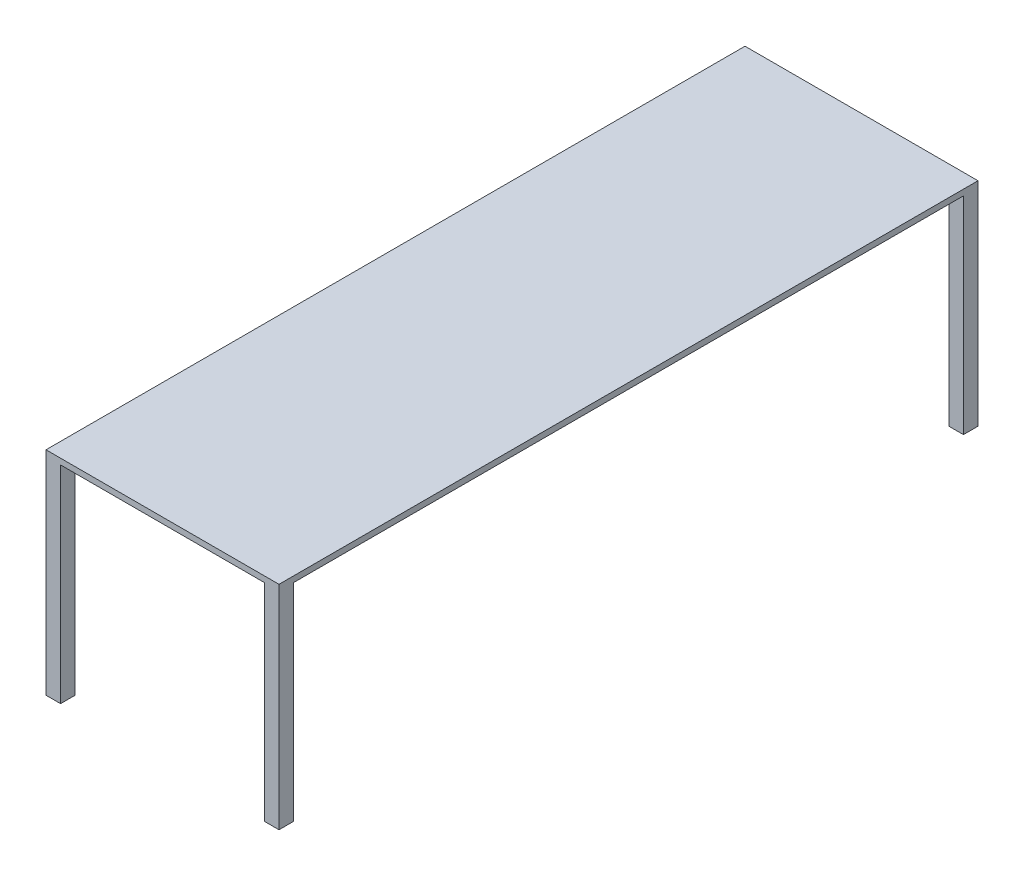
ISO-10303-21;
HEADER;
FILE_DESCRIPTION(('STEP AP214'),'2;1');
FILE_NAME('part.step','',(''),(''),'','','');
FILE_SCHEMA(('AUTOMOTIVE_DESIGN { 1 0 10303 214 1 1 1 1 }'));
ENDSEC;
DATA;
#1=APPLICATION_CONTEXT('core data for automotive mechanical design processes');
#2=APPLICATION_PROTOCOL_DEFINITION('international standard','automotive_design',2000,#1);
#3=PRODUCT_CONTEXT('',#1,'mechanical');
#4=PRODUCT('Part','Part','',(#3));
#5=PRODUCT_RELATED_PRODUCT_CATEGORY('part','',(#4));
#6=PRODUCT_DEFINITION_FORMATION('','',#4);
#7=PRODUCT_DEFINITION_CONTEXT('part definition',#1,'design');
#8=PRODUCT_DEFINITION('design','',#6,#7);
#9=PRODUCT_DEFINITION_SHAPE('','',#8);
#10=(LENGTH_UNIT() NAMED_UNIT(*) SI_UNIT(.MILLI.,.METRE.));
#11=(NAMED_UNIT(*) PLANE_ANGLE_UNIT() SI_UNIT($,.RADIAN.));
#12=(NAMED_UNIT(*) SI_UNIT($,.STERADIAN.) SOLID_ANGLE_UNIT());
#13=UNCERTAINTY_MEASURE_WITH_UNIT(LENGTH_MEASURE(1.E-05),#10,'distance_accuracy_value','');
#14=(GEOMETRIC_REPRESENTATION_CONTEXT(3) GLOBAL_UNCERTAINTY_ASSIGNED_CONTEXT((#13)) GLOBAL_UNIT_ASSIGNED_CONTEXT((#10,
#11,#12)) REPRESENTATION_CONTEXT('',''));
#15=CARTESIAN_POINT('',(0.,0.,0.));
#16=DIRECTION('',(0.,0.,1.));
#17=DIRECTION('',(1.,0.,0.));
#18=AXIS2_PLACEMENT_3D('',#15,#16,#17);
#19=CARTESIAN_POINT('',(0.,0.,0.));
#20=DIRECTION('',(0.,-1.,0.));
#21=DIRECTION('',(0.,0.,-1.));
#22=AXIS2_PLACEMENT_3D('',#19,#20,#21);
#23=PLANE('',#22);
#24=DIRECTION('',(-1.,0.,0.));
#25=VECTOR('',#24,1.);
#26=CARTESIAN_POINT('',(-400.,0.,-1150.));
#27=LINE('',#26,#25);
#28=CARTESIAN_POINT('',(-350.,0.,-1150.));
#29=VERTEX_POINT('',#28);
#30=CARTESIAN_POINT('',(-400.,0.,-1150.));
#31=VERTEX_POINT('',#30);
#32=EDGE_CURVE('E178',#29,#31,#27,.T.);
#33=ORIENTED_EDGE('',*,*,#32,.F.);
#34=DIRECTION('',(0.,0.,1.));
#35=VECTOR('',#34,1.);
#36=CARTESIAN_POINT('',(-350.,0.,-1200.));
#37=LINE('',#36,#35);
#38=CARTESIAN_POINT('',(-350.,0.,-1200.));
#39=VERTEX_POINT('',#38);
#40=EDGE_CURVE('E181',#39,#29,#37,.T.);
#41=ORIENTED_EDGE('',*,*,#40,.F.);
#42=DIRECTION('',(-1.,0.,0.));
#43=VECTOR('',#42,1.);
#44=CARTESIAN_POINT('',(-400.,0.,-1200.));
#45=LINE('',#44,#43);
#46=CARTESIAN_POINT('',(350.,0.,-1200.));
#47=VERTEX_POINT('',#46);
#48=EDGE_CURVE('E314',#47,#39,#45,.T.);
#49=ORIENTED_EDGE('',*,*,#48,.F.);
#50=DIRECTION('',(0.,0.,1.));
#51=VECTOR('',#50,1.);
#52=CARTESIAN_POINT('',(350.,0.,-1200.));
#53=LINE('',#52,#51);
#54=CARTESIAN_POINT('',(350.,0.,-1150.));
#55=VERTEX_POINT('',#54);
#56=EDGE_CURVE('E235',#47,#55,#53,.T.);
#57=ORIENTED_EDGE('',*,*,#56,.T.);
#58=DIRECTION('',(1.,0.,0.));
#59=VECTOR('',#58,1.);
#60=CARTESIAN_POINT('',(400.,0.,-1150.));
#61=LINE('',#60,#59);
#62=CARTESIAN_POINT('',(400.,0.,-1150.));
#63=VERTEX_POINT('',#62);
#64=EDGE_CURVE('E229',#55,#63,#61,.T.);
#65=ORIENTED_EDGE('',*,*,#64,.T.);
#66=DIRECTION('',(0.,0.,-1.));
#67=VECTOR('',#66,1.);
#68=CARTESIAN_POINT('',(400.,0.,1200.));
#69=LINE('',#68,#67);
#70=CARTESIAN_POINT('',(400.,0.,1150.));
#71=VERTEX_POINT('',#70);
#72=EDGE_CURVE('E296',#71,#63,#69,.T.);
#73=ORIENTED_EDGE('',*,*,#72,.F.);
#74=DIRECTION('',(1.,0.,0.));
#75=VECTOR('',#74,1.);
#76=CARTESIAN_POINT('',(400.,0.,1150.));
#77=LINE('',#76,#75);
#78=CARTESIAN_POINT('',(350.,0.,1150.));
#79=VERTEX_POINT('',#78);
#80=EDGE_CURVE('E269',#79,#71,#77,.T.);
#81=ORIENTED_EDGE('',*,*,#80,.F.);
#82=DIRECTION('',(0.,0.,-1.));
#83=VECTOR('',#82,1.);
#84=CARTESIAN_POINT('',(350.,0.,1200.));
#85=LINE('',#84,#83);
#86=CARTESIAN_POINT('',(350.,0.,1200.));
#87=VERTEX_POINT('',#86);
#88=EDGE_CURVE('E263',#87,#79,#85,.T.);
#89=ORIENTED_EDGE('',*,*,#88,.F.);
#90=DIRECTION('',(1.,0.,0.));
#91=VECTOR('',#90,1.);
#92=CARTESIAN_POINT('',(-400.,0.,1200.));
#93=LINE('',#92,#91);
#94=CARTESIAN_POINT('',(-350.,0.,1200.));
#95=VERTEX_POINT('',#94);
#96=EDGE_CURVE('E302',#95,#87,#93,.T.);
#97=ORIENTED_EDGE('',*,*,#96,.F.);
#98=DIRECTION('',(0.,0.,-1.));
#99=VECTOR('',#98,1.);
#100=CARTESIAN_POINT('',(-350.,0.,1200.));
#101=LINE('',#100,#99);
#102=CARTESIAN_POINT('',(-350.,0.,1150.));
#103=VERTEX_POINT('',#102);
#104=EDGE_CURVE('E63',#95,#103,#101,.T.);
#105=ORIENTED_EDGE('',*,*,#104,.T.);
#106=DIRECTION('',(-1.,0.,0.));
#107=VECTOR('',#106,1.);
#108=CARTESIAN_POINT('',(-400.,0.,1150.));
#109=LINE('',#108,#107);
#110=CARTESIAN_POINT('',(-400.,0.,1150.));
#111=VERTEX_POINT('',#110);
#112=EDGE_CURVE('E197',#103,#111,#109,.T.);
#113=ORIENTED_EDGE('',*,*,#112,.T.);
#114=DIRECTION('',(0.,0.,1.));
#115=VECTOR('',#114,1.);
#116=CARTESIAN_POINT('',(-400.,0.,1200.));
#117=LINE('',#116,#115);
#118=EDGE_CURVE('E317',#31,#111,#117,.T.);
#119=ORIENTED_EDGE('',*,*,#118,.F.);
#120=EDGE_LOOP('',(#33,#41,#49,#57,#65,#73,#81,#89,#97,#105,#113,#119));
#121=FACE_BOUND('',#120,.T.);
#122=ADVANCED_FACE('F39',(#121),#23,.T.);
#123=CARTESIAN_POINT('',(400.,20.,1200.));
#124=DIRECTION('',(-1.,0.,0.));
#125=DIRECTION('',(0.,0.,1.));
#126=AXIS2_PLACEMENT_3D('',#123,#124,#125);
#127=PLANE('',#126);
#128=DIRECTION('',(0.,-1.,0.));
#129=VECTOR('',#128,1.);
#130=CARTESIAN_POINT('',(400.,20.,1200.));
#131=LINE('',#130,#129);
#132=CARTESIAN_POINT('',(400.,20.,1200.));
#133=VERTEX_POINT('',#132);
#134=CARTESIAN_POINT('',(400.,-710.,1200.));
#135=VERTEX_POINT('',#134);
#136=EDGE_CURVE('E310',#133,#135,#131,.T.);
#137=ORIENTED_EDGE('',*,*,#136,.T.);
#138=DIRECTION('',(0.,0.,1.));
#139=VECTOR('',#138,1.);
#140=CARTESIAN_POINT('',(400.,-710.,1200.));
#141=LINE('',#140,#139);
#142=CARTESIAN_POINT('',(400.,-710.,1150.));
#143=VERTEX_POINT('',#142);
#144=EDGE_CURVE('E264',#143,#135,#141,.T.);
#145=ORIENTED_EDGE('',*,*,#144,.F.);
#146=DIRECTION('',(0.,1.,0.));
#147=VECTOR('',#146,1.);
#148=CARTESIAN_POINT('',(400.,-710.,1150.));
#149=LINE('',#148,#147);
#150=EDGE_CURVE('E278',#143,#71,#149,.T.);
#151=ORIENTED_EDGE('',*,*,#150,.T.);
#152=ORIENTED_EDGE('',*,*,#72,.T.);
#153=DIRECTION('',(0.,1.,0.));
#154=VECTOR('',#153,1.);
#155=CARTESIAN_POINT('',(400.,-710.,-1150.));
#156=LINE('',#155,#154);
#157=CARTESIAN_POINT('',(400.,-710.,-1150.));
#158=VERTEX_POINT('',#157);
#159=EDGE_CURVE('E260',#158,#63,#156,.T.);
#160=ORIENTED_EDGE('',*,*,#159,.F.);
#161=DIRECTION('',(0.,0.,-1.));
#162=VECTOR('',#161,1.);
#163=CARTESIAN_POINT('',(400.,-710.,-1200.));
#164=LINE('',#163,#162);
#165=CARTESIAN_POINT('',(400.,-710.,-1200.));
#166=VERTEX_POINT('',#165);
#167=EDGE_CURVE('E230',#158,#166,#164,.T.);
#168=ORIENTED_EDGE('',*,*,#167,.T.);
#169=DIRECTION('',(0.,-1.,0.));
#170=VECTOR('',#169,1.);
#171=CARTESIAN_POINT('',(400.,20.,-1200.));
#172=LINE('',#171,#170);
#173=CARTESIAN_POINT('',(400.,20.,-1200.));
#174=VERTEX_POINT('',#173);
#175=EDGE_CURVE('E11',#174,#166,#172,.T.);
#176=ORIENTED_EDGE('',*,*,#175,.F.);
#177=DIRECTION('',(0.,0.,-1.));
#178=VECTOR('',#177,1.);
#179=CARTESIAN_POINT('',(400.,20.,1200.));
#180=LINE('',#179,#178);
#181=EDGE_CURVE('E297',#133,#174,#180,.T.);
#182=ORIENTED_EDGE('',*,*,#181,.F.);
#183=EDGE_LOOP('',(#137,#145,#151,#152,#160,#168,#176,#182));
#184=FACE_BOUND('',#183,.T.);
#185=ADVANCED_FACE('F41',(#184),#127,.F.);
#186=CARTESIAN_POINT('',(-400.,20.,-1200.));
#187=DIRECTION('',(0.,0.,1.));
#188=DIRECTION('',(1.,0.,0.));
#189=AXIS2_PLACEMENT_3D('',#186,#187,#188);
#190=PLANE('',#189);
#191=ORIENTED_EDGE('',*,*,#175,.T.);
#192=DIRECTION('',(-1.,0.,0.));
#193=VECTOR('',#192,1.);
#194=CARTESIAN_POINT('',(400.,-710.,-1200.));
#195=LINE('',#194,#193);
#196=CARTESIAN_POINT('',(350.,-710.,-1200.));
#197=VERTEX_POINT('',#196);
#198=EDGE_CURVE('E243',#166,#197,#195,.T.);
#199=ORIENTED_EDGE('',*,*,#198,.T.);
#200=DIRECTION('',(0.,1.,0.));
#201=VECTOR('',#200,1.);
#202=CARTESIAN_POINT('',(350.,-710.,-1200.));
#203=LINE('',#202,#201);
#204=EDGE_CURVE('E247',#197,#47,#203,.T.);
#205=ORIENTED_EDGE('',*,*,#204,.T.);
#206=ORIENTED_EDGE('',*,*,#48,.T.);
#207=DIRECTION('',(0.,1.,0.));
#208=VECTOR('',#207,1.);
#209=CARTESIAN_POINT('',(-350.,-710.,-1200.));
#210=LINE('',#209,#208);
#211=CARTESIAN_POINT('',(-350.,-710.,-1200.));
#212=VERTEX_POINT('',#211);
#213=EDGE_CURVE('E168',#212,#39,#210,.T.);
#214=ORIENTED_EDGE('',*,*,#213,.F.);
#215=DIRECTION('',(1.,0.,0.));
#216=VECTOR('',#215,1.);
#217=CARTESIAN_POINT('',(-400.,-710.,-1200.));
#218=LINE('',#217,#216);
#219=CARTESIAN_POINT('',(-400.,-710.,-1200.));
#220=VERTEX_POINT('',#219);
#221=EDGE_CURVE('E165',#220,#212,#218,.T.);
#222=ORIENTED_EDGE('',*,*,#221,.F.);
#223=DIRECTION('',(0.,-1.,0.));
#224=VECTOR('',#223,1.);
#225=CARTESIAN_POINT('',(-400.,20.,-1200.));
#226=LINE('',#225,#224);
#227=CARTESIAN_POINT('',(-400.,20.,-1200.));
#228=VERTEX_POINT('',#227);
#229=EDGE_CURVE('E48',#228,#220,#226,.T.);
#230=ORIENTED_EDGE('',*,*,#229,.F.);
#231=DIRECTION('',(-1.,0.,0.));
#232=VECTOR('',#231,1.);
#233=CARTESIAN_POINT('',(-400.,20.,-1200.));
#234=LINE('',#233,#232);
#235=EDGE_CURVE('E301',#174,#228,#234,.T.);
#236=ORIENTED_EDGE('',*,*,#235,.F.);
#237=EDGE_LOOP('',(#191,#199,#205,#206,#214,#222,#230,#236));
#238=FACE_BOUND('',#237,.T.);
#239=ADVANCED_FACE('F166',(#238),#190,.F.);
#240=CARTESIAN_POINT('',(-400.,20.,1200.));
#241=DIRECTION('',(1.,0.,0.));
#242=DIRECTION('',(0.,0.,-1.));
#243=AXIS2_PLACEMENT_3D('',#240,#241,#242);
#244=PLANE('',#243);
#245=ORIENTED_EDGE('',*,*,#229,.T.);
#246=DIRECTION('',(0.,0.,-1.));
#247=VECTOR('',#246,1.);
#248=CARTESIAN_POINT('',(-400.,-710.,-1200.));
#249=LINE('',#248,#247);
#250=CARTESIAN_POINT('',(-400.,-710.,-1150.));
#251=VERTEX_POINT('',#250);
#252=EDGE_CURVE('E158',#251,#220,#249,.T.);
#253=ORIENTED_EDGE('',*,*,#252,.F.);
#254=DIRECTION('',(0.,1.,0.));
#255=VECTOR('',#254,1.);
#256=CARTESIAN_POINT('',(-400.,-710.,-1150.));
#257=LINE('',#256,#255);
#258=EDGE_CURVE('E188',#251,#31,#257,.T.);
#259=ORIENTED_EDGE('',*,*,#258,.T.);
#260=ORIENTED_EDGE('',*,*,#118,.T.);
#261=DIRECTION('',(0.,1.,0.));
#262=VECTOR('',#261,1.);
#263=CARTESIAN_POINT('',(-400.,-710.,1150.));
#264=LINE('',#263,#262);
#265=CARTESIAN_POINT('',(-400.,-710.,1150.));
#266=VERTEX_POINT('',#265);
#267=EDGE_CURVE('E225',#266,#111,#264,.T.);
#268=ORIENTED_EDGE('',*,*,#267,.F.);
#269=DIRECTION('',(0.,0.,1.));
#270=VECTOR('',#269,1.);
#271=CARTESIAN_POINT('',(-400.,-710.,1200.));
#272=LINE('',#271,#270);
#273=CARTESIAN_POINT('',(-400.,-710.,1200.));
#274=VERTEX_POINT('',#273);
#275=EDGE_CURVE('E198',#266,#274,#272,.T.);
#276=ORIENTED_EDGE('',*,*,#275,.T.);
#277=DIRECTION('',(0.,-1.,0.));
#278=VECTOR('',#277,1.);
#279=CARTESIAN_POINT('',(-400.,20.,1200.));
#280=LINE('',#279,#278);
#281=CARTESIAN_POINT('',(-400.,20.,1200.));
#282=VERTEX_POINT('',#281);
#283=EDGE_CURVE('E163',#282,#274,#280,.T.);
#284=ORIENTED_EDGE('',*,*,#283,.F.);
#285=DIRECTION('',(0.,0.,1.));
#286=VECTOR('',#285,1.);
#287=CARTESIAN_POINT('',(-400.,20.,1200.));
#288=LINE('',#287,#286);
#289=EDGE_CURVE('E160',#228,#282,#288,.T.);
#290=ORIENTED_EDGE('',*,*,#289,.F.);
#291=EDGE_LOOP('',(#245,#253,#259,#260,#268,#276,#284,#290));
#292=FACE_BOUND('',#291,.T.);
#293=ADVANCED_FACE('F155',(#292),#244,.F.);
#294=CARTESIAN_POINT('',(-400.,20.,1200.));
#295=DIRECTION('',(0.,0.,-1.));
#296=DIRECTION('',(-1.,0.,0.));
#297=AXIS2_PLACEMENT_3D('',#294,#295,#296);
#298=PLANE('',#297);
#299=ORIENTED_EDGE('',*,*,#283,.T.);
#300=DIRECTION('',(1.,0.,0.));
#301=VECTOR('',#300,1.);
#302=CARTESIAN_POINT('',(-400.,-710.,1200.));
#303=LINE('',#302,#301);
#304=CARTESIAN_POINT('',(-350.,-710.,1200.));
#305=VERTEX_POINT('',#304);
#306=EDGE_CURVE('E210',#274,#305,#303,.T.);
#307=ORIENTED_EDGE('',*,*,#306,.T.);
#308=DIRECTION('',(0.,1.,0.));
#309=VECTOR('',#308,1.);
#310=CARTESIAN_POINT('',(-350.,-710.,1200.));
#311=LINE('',#310,#309);
#312=EDGE_CURVE('E214',#305,#95,#311,.T.);
#313=ORIENTED_EDGE('',*,*,#312,.T.);
#314=ORIENTED_EDGE('',*,*,#96,.T.);
#315=DIRECTION('',(0.,1.,0.));
#316=VECTOR('',#315,1.);
#317=CARTESIAN_POINT('',(350.,-710.,1200.));
#318=LINE('',#317,#316);
#319=CARTESIAN_POINT('',(350.,-710.,1200.));
#320=VERTEX_POINT('',#319);
#321=EDGE_CURVE('E292',#320,#87,#318,.T.);
#322=ORIENTED_EDGE('',*,*,#321,.F.);
#323=DIRECTION('',(-1.,0.,0.));
#324=VECTOR('',#323,1.);
#325=CARTESIAN_POINT('',(400.,-710.,1200.));
#326=LINE('',#325,#324);
#327=EDGE_CURVE('E268',#135,#320,#326,.T.);
#328=ORIENTED_EDGE('',*,*,#327,.F.);
#329=ORIENTED_EDGE('',*,*,#136,.F.);
#330=DIRECTION('',(1.,0.,0.));
#331=VECTOR('',#330,1.);
#332=CARTESIAN_POINT('',(-400.,20.,1200.));
#333=LINE('',#332,#331);
#334=EDGE_CURVE('E307',#282,#133,#333,.T.);
#335=ORIENTED_EDGE('',*,*,#334,.F.);
#336=EDGE_LOOP('',(#299,#307,#313,#314,#322,#328,#329,#335));
#337=FACE_BOUND('',#336,.T.);
#338=ADVANCED_FACE('F327',(#337),#298,.F.);
#339=CARTESIAN_POINT('',(0.,20.,0.));
#340=DIRECTION('',(0.,-1.,0.));
#341=DIRECTION('',(0.,0.,-1.));
#342=AXIS2_PLACEMENT_3D('',#339,#340,#341);
#343=PLANE('',#342);
#344=ORIENTED_EDGE('',*,*,#181,.T.);
#345=ORIENTED_EDGE('',*,*,#235,.T.);
#346=ORIENTED_EDGE('',*,*,#289,.T.);
#347=ORIENTED_EDGE('',*,*,#334,.T.);
#348=EDGE_LOOP('',(#344,#345,#346,#347));
#349=FACE_BOUND('',#348,.T.);
#350=ADVANCED_FACE('F356',(#349),#343,.F.);
#351=CARTESIAN_POINT('',(350.,-710.,1200.));
#352=DIRECTION('',(1.,0.,0.));
#353=DIRECTION('',(0.,0.,-1.));
#354=AXIS2_PLACEMENT_3D('',#351,#352,#353);
#355=PLANE('',#354);
#356=ORIENTED_EDGE('',*,*,#88,.T.);
#357=DIRECTION('',(0.,1.,0.));
#358=VECTOR('',#357,1.);
#359=CARTESIAN_POINT('',(350.,-710.,1150.));
#360=LINE('',#359,#358);
#361=CARTESIAN_POINT('',(350.,-710.,1150.));
#362=VERTEX_POINT('',#361);
#363=EDGE_CURVE('E288',#362,#79,#360,.T.);
#364=ORIENTED_EDGE('',*,*,#363,.F.);
#365=DIRECTION('',(0.,0.,-1.));
#366=VECTOR('',#365,1.);
#367=CARTESIAN_POINT('',(350.,-710.,1200.));
#368=LINE('',#367,#366);
#369=EDGE_CURVE('E272',#320,#362,#368,.T.);
#370=ORIENTED_EDGE('',*,*,#369,.F.);
#371=ORIENTED_EDGE('',*,*,#321,.T.);
#372=EDGE_LOOP('',(#356,#364,#370,#371));
#373=FACE_BOUND('',#372,.T.);
#374=ADVANCED_FACE('F345',(#373),#355,.F.);
#375=CARTESIAN_POINT('',(400.,-710.,1150.));
#376=DIRECTION('',(0.,0.,1.));
#377=DIRECTION('',(1.,0.,0.));
#378=AXIS2_PLACEMENT_3D('',#375,#376,#377);
#379=PLANE('',#378);
#380=ORIENTED_EDGE('',*,*,#80,.T.);
#381=ORIENTED_EDGE('',*,*,#150,.F.);
#382=DIRECTION('',(1.,0.,0.));
#383=VECTOR('',#382,1.);
#384=CARTESIAN_POINT('',(400.,-710.,1150.));
#385=LINE('',#384,#383);
#386=EDGE_CURVE('E275',#362,#143,#385,.T.);
#387=ORIENTED_EDGE('',*,*,#386,.F.);
#388=ORIENTED_EDGE('',*,*,#363,.T.);
#389=EDGE_LOOP('',(#380,#381,#387,#388));
#390=FACE_BOUND('',#389,.T.);
#391=ADVANCED_FACE('F414',(#390),#379,.F.);
#392=CARTESIAN_POINT('',(0.,-710.,0.));
#393=DIRECTION('',(0.,1.,0.));
#394=DIRECTION('',(0.,0.,1.));
#395=AXIS2_PLACEMENT_3D('',#392,#393,#394);
#396=PLANE('',#395);
#397=ORIENTED_EDGE('',*,*,#144,.T.);
#398=ORIENTED_EDGE('',*,*,#327,.T.);
#399=ORIENTED_EDGE('',*,*,#369,.T.);
#400=ORIENTED_EDGE('',*,*,#386,.T.);
#401=EDGE_LOOP('',(#397,#398,#399,#400));
#402=FACE_BOUND('',#401,.T.);
#403=ADVANCED_FACE('F350',(#402),#396,.F.);
#404=CARTESIAN_POINT('',(400.,-710.,-1150.));
#405=DIRECTION('',(0.,0.,1.));
#406=DIRECTION('',(1.,0.,0.));
#407=AXIS2_PLACEMENT_3D('',#404,#405,#406);
#408=PLANE('',#407);
#409=ORIENTED_EDGE('',*,*,#64,.F.);
#410=DIRECTION('',(0.,1.,0.));
#411=VECTOR('',#410,1.);
#412=CARTESIAN_POINT('',(350.,-710.,-1150.));
#413=LINE('',#412,#411);
#414=CARTESIAN_POINT('',(350.,-710.,-1150.));
#415=VERTEX_POINT('',#414);
#416=EDGE_CURVE('E257',#415,#55,#413,.T.);
#417=ORIENTED_EDGE('',*,*,#416,.F.);
#418=DIRECTION('',(1.,0.,0.));
#419=VECTOR('',#418,1.);
#420=CARTESIAN_POINT('',(400.,-710.,-1150.));
#421=LINE('',#420,#419);
#422=EDGE_CURVE('E234',#415,#158,#421,.T.);
#423=ORIENTED_EDGE('',*,*,#422,.T.);
#424=ORIENTED_EDGE('',*,*,#159,.T.);
#425=EDGE_LOOP('',(#409,#417,#423,#424));
#426=FACE_BOUND('',#425,.T.);
#427=ADVANCED_FACE('F428',(#426),#408,.T.);
#428=CARTESIAN_POINT('',(350.,-710.,-1200.));
#429=DIRECTION('',(-1.,0.,0.));
#430=DIRECTION('',(0.,0.,1.));
#431=AXIS2_PLACEMENT_3D('',#428,#429,#430);
#432=PLANE('',#431);
#433=ORIENTED_EDGE('',*,*,#56,.F.);
#434=ORIENTED_EDGE('',*,*,#204,.F.);
#435=DIRECTION('',(0.,0.,1.));
#436=VECTOR('',#435,1.);
#437=CARTESIAN_POINT('',(350.,-710.,-1200.));
#438=LINE('',#437,#436);
#439=EDGE_CURVE('E239',#197,#415,#438,.T.);
#440=ORIENTED_EDGE('',*,*,#439,.T.);
#441=ORIENTED_EDGE('',*,*,#416,.T.);
#442=EDGE_LOOP('',(#433,#434,#440,#441));
#443=FACE_BOUND('',#442,.T.);
#444=ADVANCED_FACE('F364',(#443),#432,.T.);
#445=CARTESIAN_POINT('',(0.,-710.,0.));
#446=DIRECTION('',(0.,1.,0.));
#447=DIRECTION('',(0.,0.,-1.));
#448=AXIS2_PLACEMENT_3D('',#445,#446,#447);
#449=PLANE('',#448);
#450=ORIENTED_EDGE('',*,*,#167,.F.);
#451=ORIENTED_EDGE('',*,*,#422,.F.);
#452=ORIENTED_EDGE('',*,*,#439,.F.);
#453=ORIENTED_EDGE('',*,*,#198,.F.);
#454=EDGE_LOOP('',(#450,#451,#452,#453));
#455=FACE_BOUND('',#454,.T.);
#456=ADVANCED_FACE('F362',(#455),#449,.F.);
#457=CARTESIAN_POINT('',(-400.,-710.,1150.));
#458=DIRECTION('',(0.,0.,-1.));
#459=DIRECTION('',(-1.,0.,0.));
#460=AXIS2_PLACEMENT_3D('',#457,#458,#459);
#461=PLANE('',#460);
#462=ORIENTED_EDGE('',*,*,#112,.F.);
#463=DIRECTION('',(0.,1.,0.));
#464=VECTOR('',#463,1.);
#465=CARTESIAN_POINT('',(-350.,-710.,1150.));
#466=LINE('',#465,#464);
#467=CARTESIAN_POINT('',(-350.,-710.,1150.));
#468=VERTEX_POINT('',#467);
#469=EDGE_CURVE('E222',#468,#103,#466,.T.);
#470=ORIENTED_EDGE('',*,*,#469,.F.);
#471=DIRECTION('',(-1.,0.,0.));
#472=VECTOR('',#471,1.);
#473=CARTESIAN_POINT('',(-400.,-710.,1150.));
#474=LINE('',#473,#472);
#475=EDGE_CURVE('E202',#468,#266,#474,.T.);
#476=ORIENTED_EDGE('',*,*,#475,.T.);
#477=ORIENTED_EDGE('',*,*,#267,.T.);
#478=EDGE_LOOP('',(#462,#470,#476,#477));
#479=FACE_BOUND('',#478,.T.);
#480=ADVANCED_FACE('F373',(#479),#461,.T.);
#481=CARTESIAN_POINT('',(-350.,-710.,1200.));
#482=DIRECTION('',(1.,0.,0.));
#483=DIRECTION('',(0.,0.,-1.));
#484=AXIS2_PLACEMENT_3D('',#481,#482,#483);
#485=PLANE('',#484);
#486=ORIENTED_EDGE('',*,*,#104,.F.);
#487=ORIENTED_EDGE('',*,*,#312,.F.);
#488=DIRECTION('',(0.,0.,-1.));
#489=VECTOR('',#488,1.);
#490=CARTESIAN_POINT('',(-350.,-710.,1200.));
#491=LINE('',#490,#489);
#492=EDGE_CURVE('E206',#305,#468,#491,.T.);
#493=ORIENTED_EDGE('',*,*,#492,.T.);
#494=ORIENTED_EDGE('',*,*,#469,.T.);
#495=EDGE_LOOP('',(#486,#487,#493,#494));
#496=FACE_BOUND('',#495,.T.);
#497=ADVANCED_FACE('F335',(#496),#485,.T.);
#498=CARTESIAN_POINT('',(0.,-710.,0.));
#499=DIRECTION('',(0.,1.,0.));
#500=DIRECTION('',(0.,0.,1.));
#501=AXIS2_PLACEMENT_3D('',#498,#499,#500);
#502=PLANE('',#501);
#503=ORIENTED_EDGE('',*,*,#275,.F.);
#504=ORIENTED_EDGE('',*,*,#475,.F.);
#505=ORIENTED_EDGE('',*,*,#492,.F.);
#506=ORIENTED_EDGE('',*,*,#306,.F.);
#507=EDGE_LOOP('',(#503,#504,#505,#506));
#508=FACE_BOUND('',#507,.T.);
#509=ADVANCED_FACE('F334',(#508),#502,.F.);
#510=CARTESIAN_POINT('',(-350.,-710.,-1200.));
#511=DIRECTION('',(-1.,0.,0.));
#512=DIRECTION('',(0.,0.,1.));
#513=AXIS2_PLACEMENT_3D('',#510,#511,#512);
#514=PLANE('',#513);
#515=ORIENTED_EDGE('',*,*,#40,.T.);
#516=DIRECTION('',(0.,1.,0.));
#517=VECTOR('',#516,1.);
#518=CARTESIAN_POINT('',(-350.,-710.,-1150.));
#519=LINE('',#518,#517);
#520=CARTESIAN_POINT('',(-350.,-710.,-1150.));
#521=VERTEX_POINT('',#520);
#522=EDGE_CURVE('E55',#521,#29,#519,.T.);
#523=ORIENTED_EDGE('',*,*,#522,.F.);
#524=DIRECTION('',(0.,0.,1.));
#525=VECTOR('',#524,1.);
#526=CARTESIAN_POINT('',(-350.,-710.,-1200.));
#527=LINE('',#526,#525);
#528=EDGE_CURVE('E172',#212,#521,#527,.T.);
#529=ORIENTED_EDGE('',*,*,#528,.F.);
#530=ORIENTED_EDGE('',*,*,#213,.T.);
#531=EDGE_LOOP('',(#515,#523,#529,#530));
#532=FACE_BOUND('',#531,.T.);
#533=ADVANCED_FACE('F370',(#532),#514,.F.);
#534=CARTESIAN_POINT('',(-400.,-710.,-1150.));
#535=DIRECTION('',(0.,0.,-1.));
#536=DIRECTION('',(-1.,0.,0.));
#537=AXIS2_PLACEMENT_3D('',#534,#535,#536);
#538=PLANE('',#537);
#539=ORIENTED_EDGE('',*,*,#32,.T.);
#540=ORIENTED_EDGE('',*,*,#258,.F.);
#541=DIRECTION('',(-1.,0.,0.));
#542=VECTOR('',#541,1.);
#543=CARTESIAN_POINT('',(-400.,-710.,-1150.));
#544=LINE('',#543,#542);
#545=EDGE_CURVE('E175',#521,#251,#544,.T.);
#546=ORIENTED_EDGE('',*,*,#545,.F.);
#547=ORIENTED_EDGE('',*,*,#522,.T.);
#548=EDGE_LOOP('',(#539,#540,#546,#547));
#549=FACE_BOUND('',#548,.T.);
#550=ADVANCED_FACE('F371',(#549),#538,.F.);
#551=CARTESIAN_POINT('',(0.,-710.,0.));
#552=DIRECTION('',(0.,1.,0.));
#553=DIRECTION('',(0.,0.,-1.));
#554=AXIS2_PLACEMENT_3D('',#551,#552,#553);
#555=PLANE('',#554);
#556=ORIENTED_EDGE('',*,*,#252,.T.);
#557=ORIENTED_EDGE('',*,*,#221,.T.);
#558=ORIENTED_EDGE('',*,*,#528,.T.);
#559=ORIENTED_EDGE('',*,*,#545,.T.);
#560=EDGE_LOOP('',(#556,#557,#558,#559));
#561=FACE_BOUND('',#560,.T.);
#562=ADVANCED_FACE('F174',(#561),#555,.F.);
#563=CLOSED_SHELL('',(#122,#185,#239,#293,#338,#350,#374,#391,#403,#427,#444,#456,#480,#497,
#509,#533,#550,#562));
#564=MANIFOLD_SOLID_BREP('B2',#563);
#565=ADVANCED_BREP_SHAPE_REPRESENTATION('',(#18,#564),#14);
#566=SHAPE_DEFINITION_REPRESENTATION(#9,#565);
ENDSEC;
END-ISO-10303-21;
